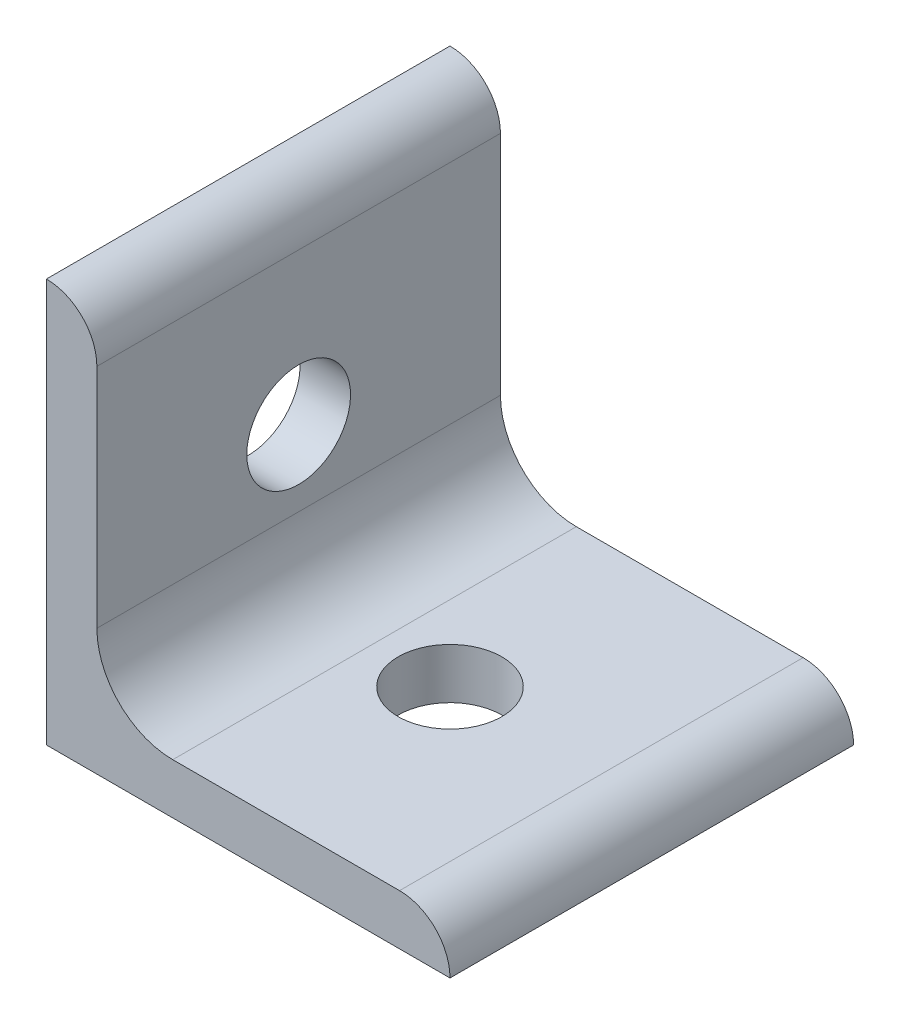
ISO-10303-21;
HEADER;
FILE_DESCRIPTION(('STEP AP214'),'2;1');
FILE_NAME('part.step','',(''),(''),'','','');
FILE_SCHEMA(('AUTOMOTIVE_DESIGN { 1 0 10303 214 1 1 1 1 }'));
ENDSEC;
DATA;
#1=APPLICATION_CONTEXT('core data for automotive mechanical design processes');
#2=APPLICATION_PROTOCOL_DEFINITION('international standard','automotive_design',2000,#1);
#3=PRODUCT_CONTEXT('',#1,'mechanical');
#4=PRODUCT('Part','Part','',(#3));
#5=PRODUCT_RELATED_PRODUCT_CATEGORY('part','',(#4));
#6=PRODUCT_DEFINITION_FORMATION('','',#4);
#7=PRODUCT_DEFINITION_CONTEXT('part definition',#1,'design');
#8=PRODUCT_DEFINITION('design','',#6,#7);
#9=PRODUCT_DEFINITION_SHAPE('','',#8);
#10=(LENGTH_UNIT() NAMED_UNIT(*) SI_UNIT(.MILLI.,.METRE.));
#11=(NAMED_UNIT(*) PLANE_ANGLE_UNIT() SI_UNIT($,.RADIAN.));
#12=(NAMED_UNIT(*) SI_UNIT($,.STERADIAN.) SOLID_ANGLE_UNIT());
#13=UNCERTAINTY_MEASURE_WITH_UNIT(LENGTH_MEASURE(1.E-05),#10,'distance_accuracy_value','');
#14=(GEOMETRIC_REPRESENTATION_CONTEXT(3) GLOBAL_UNCERTAINTY_ASSIGNED_CONTEXT((#13)) GLOBAL_UNIT_ASSIGNED_CONTEXT((#10,
#11,#12)) REPRESENTATION_CONTEXT('',''));
#15=CARTESIAN_POINT('',(0.,0.,0.));
#16=DIRECTION('',(0.,0.,1.));
#17=DIRECTION('',(1.,0.,0.));
#18=AXIS2_PLACEMENT_3D('',#15,#16,#17);
#19=CARTESIAN_POINT('',(23.47304696449,-4.87140320733104,0.));
#20=DIRECTION('',(0.,0.,1.));
#21=DIRECTION('',(1.,0.,0.));
#22=AXIS2_PLACEMENT_3D('',#19,#20,#21);
#23=CYLINDRICAL_SURFACE('',#22,3.175);
#24=CARTESIAN_POINT('',(23.47304696449,-4.87140320733104,25.4));
#25=DIRECTION('',(0.,0.,1.));
#26=DIRECTION('',(1.,0.,0.));
#27=AXIS2_PLACEMENT_3D('',#24,#25,#26);
#28=CIRCLE('',#27,3.175);
#29=CARTESIAN_POINT('',(26.64804696449,-4.87140320733101,25.4));
#30=VERTEX_POINT('',#29);
#31=CARTESIAN_POINT('',(23.47304696449,-1.69640320733104,25.4));
#32=VERTEX_POINT('',#31);
#33=EDGE_CURVE('E131',#30,#32,#28,.T.);
#34=ORIENTED_EDGE('',*,*,#33,.F.);
#35=DIRECTION('',(0.,0.,1.));
#36=VECTOR('',#35,1.);
#37=CARTESIAN_POINT('',(26.64804696449,-4.87140320733101,0.));
#38=LINE('',#37,#36);
#39=CARTESIAN_POINT('',(26.64804696449,-4.87140320733101,0.));
#40=VERTEX_POINT('',#39);
#41=EDGE_CURVE('E114',#40,#30,#38,.T.);
#42=ORIENTED_EDGE('',*,*,#41,.F.);
#43=CARTESIAN_POINT('',(23.47304696449,-4.87140320733104,0.));
#44=DIRECTION('',(0.,0.,1.));
#45=DIRECTION('',(1.,0.,0.));
#46=AXIS2_PLACEMENT_3D('',#43,#44,#45);
#47=CIRCLE('',#46,3.175);
#48=CARTESIAN_POINT('',(23.47304696449,-1.69640320733104,0.));
#49=VERTEX_POINT('',#48);
#50=EDGE_CURVE('E107',#40,#49,#47,.T.);
#51=ORIENTED_EDGE('',*,*,#50,.T.);
#52=DIRECTION('',(0.,0.,1.));
#53=VECTOR('',#52,1.);
#54=CARTESIAN_POINT('',(23.47304696449,-1.69640320733104,0.));
#55=LINE('',#54,#53);
#56=EDGE_CURVE('E90',#49,#32,#55,.T.);
#57=ORIENTED_EDGE('',*,*,#56,.T.);
#58=EDGE_LOOP('',(#34,#42,#51,#57));
#59=FACE_BOUND('',#58,.T.);
#60=ADVANCED_FACE('F33',(#59),#23,.T.);
#61=CARTESIAN_POINT('',(26.6480469644902,-23.921403207331,0.));
#62=DIRECTION('',(1.,0.,0.));
#63=DIRECTION('',(0.,1.,0.));
#64=AXIS2_PLACEMENT_3D('',#61,#62,#63);
#65=PLANE('',#64);
#66=CARTESIAN_POINT('',(26.6480469644901,-14.396403207331,12.7));
#67=DIRECTION('',(1.,0.,0.));
#68=DIRECTION('',(0.,1.,0.));
#69=AXIS2_PLACEMENT_3D('',#66,#67,#68);
#70=CIRCLE('',#69,3.26389999999999);
#71=CARTESIAN_POINT('',(26.6480469644901,-11.1325032073311,12.7));
#72=VERTEX_POINT('',#71);
#73=EDGE_CURVE('E204',#72,#72,#70,.T.);
#74=ORIENTED_EDGE('',*,*,#73,.F.);
#75=EDGE_LOOP('',(#74));
#76=FACE_BOUND('',#75,.T.);
#77=DIRECTION('',(0.,1.,0.));
#78=VECTOR('',#77,1.);
#79=CARTESIAN_POINT('',(26.6480469644902,-23.921403207331,25.4));
#80=LINE('',#79,#78);
#81=CARTESIAN_POINT('',(26.6480469644902,-19.146203207331,25.4));
#82=VERTEX_POINT('',#81);
#83=EDGE_CURVE('E115',#82,#30,#80,.T.);
#84=ORIENTED_EDGE('',*,*,#83,.F.);
#85=DIRECTION('',(0.,0.,1.));
#86=VECTOR('',#85,1.);
#87=CARTESIAN_POINT('',(26.6480469644902,-19.146203207331,0.));
#88=LINE('',#87,#86);
#89=CARTESIAN_POINT('',(26.6480469644902,-19.146203207331,0.));
#90=VERTEX_POINT('',#89);
#91=EDGE_CURVE('E48',#82,#90,#88,.F.);
#92=ORIENTED_EDGE('',*,*,#91,.T.);
#93=DIRECTION('',(0.,1.,0.));
#94=VECTOR('',#93,1.);
#95=CARTESIAN_POINT('',(26.6480469644902,-23.921403207331,0.));
#96=LINE('',#95,#94);
#97=EDGE_CURVE('E101',#90,#40,#96,.T.);
#98=ORIENTED_EDGE('',*,*,#97,.T.);
#99=ORIENTED_EDGE('',*,*,#41,.T.);
#100=EDGE_LOOP('',(#84,#92,#98,#99));
#101=FACE_BOUND('',#100,.T.);
#102=ADVANCED_FACE('F171',(#76,#101),#65,.T.);
#103=CARTESIAN_POINT('',(45.6980469644902,-23.9214032073307,0.));
#104=DIRECTION('',(0.,1.,0.));
#105=DIRECTION('',(-1.,0.,0.));
#106=AXIS2_PLACEMENT_3D('',#103,#104,#105);
#107=PLANE('',#106);
#108=CARTESIAN_POINT('',(36.1730469644901,-23.9214032073308,12.7));
#109=DIRECTION('',(0.,1.,0.));
#110=DIRECTION('',(-1.,0.,0.));
#111=AXIS2_PLACEMENT_3D('',#108,#109,#110);
#112=CIRCLE('',#111,3.26389999999999);
#113=CARTESIAN_POINT('',(32.9091469644901,-23.9214032073309,12.7));
#114=VERTEX_POINT('',#113);
#115=EDGE_CURVE('E120',#114,#114,#112,.T.);
#116=ORIENTED_EDGE('',*,*,#115,.F.);
#117=EDGE_LOOP('',(#116));
#118=FACE_BOUND('',#117,.T.);
#119=DIRECTION('',(-1.,0.,0.));
#120=VECTOR('',#119,1.);
#121=CARTESIAN_POINT('',(45.6980469644902,-23.9214032073307,0.));
#122=LINE('',#121,#120);
#123=CARTESIAN_POINT('',(45.6980469644902,-23.9214032073309,0.));
#124=VERTEX_POINT('',#123);
#125=CARTESIAN_POINT('',(31.4232469644903,-23.9214032073309,0.));
#126=VERTEX_POINT('',#125);
#127=EDGE_CURVE('E127',#124,#126,#122,.T.);
#128=ORIENTED_EDGE('',*,*,#127,.T.);
#129=DIRECTION('',(0.,0.,1.));
#130=VECTOR('',#129,1.);
#131=CARTESIAN_POINT('',(31.4232469644903,-23.9214032073309,25.4));
#132=LINE('',#131,#130);
#133=CARTESIAN_POINT('',(31.4232469644903,-23.9214032073309,25.4));
#134=VERTEX_POINT('',#133);
#135=EDGE_CURVE('E142',#126,#134,#132,.T.);
#136=ORIENTED_EDGE('',*,*,#135,.T.);
#137=DIRECTION('',(-1.,0.,0.));
#138=VECTOR('',#137,1.);
#139=CARTESIAN_POINT('',(45.6980469644902,-23.9214032073307,25.4));
#140=LINE('',#139,#138);
#141=CARTESIAN_POINT('',(45.6980469644902,-23.9214032073309,25.4));
#142=VERTEX_POINT('',#141);
#143=EDGE_CURVE('E117',#142,#134,#140,.T.);
#144=ORIENTED_EDGE('',*,*,#143,.F.);
#145=DIRECTION('',(0.,0.,1.));
#146=VECTOR('',#145,1.);
#147=CARTESIAN_POINT('',(45.6980469644902,-23.9214032073309,0.));
#148=LINE('',#147,#146);
#149=EDGE_CURVE('E143',#124,#142,#148,.T.);
#150=ORIENTED_EDGE('',*,*,#149,.F.);
#151=EDGE_LOOP('',(#128,#136,#144,#150));
#152=FACE_BOUND('',#151,.T.);
#153=ADVANCED_FACE('F153',(#118,#152),#107,.T.);
#154=CARTESIAN_POINT('',(45.6980469644903,-27.096403207331,0.));
#155=DIRECTION('',(0.,0.,1.));
#156=DIRECTION('',(1.,0.,0.));
#157=AXIS2_PLACEMENT_3D('',#154,#155,#156);
#158=CYLINDRICAL_SURFACE('',#157,3.17500000000017);
#159=CARTESIAN_POINT('',(45.6980469644903,-27.096403207331,25.4));
#160=DIRECTION('',(0.,0.,1.));
#161=DIRECTION('',(1.,0.,0.));
#162=AXIS2_PLACEMENT_3D('',#159,#160,#161);
#163=CIRCLE('',#162,3.17500000000017);
#164=CARTESIAN_POINT('',(48.8730469644903,-27.096403207331,25.4));
#165=VERTEX_POINT('',#164);
#166=EDGE_CURVE('E137',#165,#142,#163,.T.);
#167=ORIENTED_EDGE('',*,*,#166,.F.);
#168=DIRECTION('',(0.,0.,1.));
#169=VECTOR('',#168,1.);
#170=CARTESIAN_POINT('',(48.8730469644903,-27.096403207331,0.));
#171=LINE('',#170,#169);
#172=CARTESIAN_POINT('',(48.8730469644903,-27.096403207331,0.));
#173=VERTEX_POINT('',#172);
#174=EDGE_CURVE('E145',#173,#165,#171,.T.);
#175=ORIENTED_EDGE('',*,*,#174,.F.);
#176=CARTESIAN_POINT('',(45.6980469644903,-27.096403207331,0.));
#177=DIRECTION('',(0.,0.,1.));
#178=DIRECTION('',(1.,0.,0.));
#179=AXIS2_PLACEMENT_3D('',#176,#177,#178);
#180=CIRCLE('',#179,3.17500000000017);
#181=EDGE_CURVE('E124',#173,#124,#180,.T.);
#182=ORIENTED_EDGE('',*,*,#181,.T.);
#183=ORIENTED_EDGE('',*,*,#149,.T.);
#184=EDGE_LOOP('',(#167,#175,#182,#183));
#185=FACE_BOUND('',#184,.T.);
#186=ADVANCED_FACE('F161',(#185),#158,.T.);
#187=CARTESIAN_POINT('',(23.47304696449,-27.096403207331,0.));
#188=DIRECTION('',(0.,-1.,0.));
#189=DIRECTION('',(0.,0.,-1.));
#190=AXIS2_PLACEMENT_3D('',#187,#188,#189);
#191=PLANE('',#190);
#192=CARTESIAN_POINT('',(36.1730469644901,-27.096403207331,12.7));
#193=DIRECTION('',(0.,-1.,0.));
#194=DIRECTION('',(0.,0.,-1.));
#195=AXIS2_PLACEMENT_3D('',#192,#193,#194);
#196=CIRCLE('',#195,3.26389999999999);
#197=CARTESIAN_POINT('',(36.1730469644901,-27.096403207331,9.43610000000001));
#198=VERTEX_POINT('',#197);
#199=EDGE_CURVE('E203',#198,#198,#196,.T.);
#200=ORIENTED_EDGE('',*,*,#199,.F.);
#201=EDGE_LOOP('',(#200));
#202=FACE_BOUND('',#201,.T.);
#203=DIRECTION('',(1.,0.,0.));
#204=VECTOR('',#203,1.);
#205=CARTESIAN_POINT('',(23.47304696449,-27.096403207331,25.4));
#206=LINE('',#205,#204);
#207=CARTESIAN_POINT('',(23.47304696449,-27.096403207331,25.4));
#208=VERTEX_POINT('',#207);
#209=EDGE_CURVE('E134',#208,#165,#206,.T.);
#210=ORIENTED_EDGE('',*,*,#209,.F.);
#211=DIRECTION('',(0.,0.,1.));
#212=VECTOR('',#211,1.);
#213=CARTESIAN_POINT('',(23.47304696449,-27.096403207331,0.));
#214=LINE('',#213,#212);
#215=CARTESIAN_POINT('',(23.47304696449,-27.096403207331,0.));
#216=VERTEX_POINT('',#215);
#217=EDGE_CURVE('E100',#216,#208,#214,.T.);
#218=ORIENTED_EDGE('',*,*,#217,.F.);
#219=DIRECTION('',(1.,0.,0.));
#220=VECTOR('',#219,1.);
#221=CARTESIAN_POINT('',(23.47304696449,-27.096403207331,0.));
#222=LINE('',#221,#220);
#223=EDGE_CURVE('E110',#216,#173,#222,.T.);
#224=ORIENTED_EDGE('',*,*,#223,.T.);
#225=ORIENTED_EDGE('',*,*,#174,.T.);
#226=EDGE_LOOP('',(#210,#218,#224,#225));
#227=FACE_BOUND('',#226,.T.);
#228=ADVANCED_FACE('F180',(#202,#227),#191,.T.);
#229=CARTESIAN_POINT('',(23.47304696449,-1.69640320733104,0.));
#230=DIRECTION('',(-1.,0.,0.));
#231=DIRECTION('',(0.,-1.,0.));
#232=AXIS2_PLACEMENT_3D('',#229,#230,#231);
#233=PLANE('',#232);
#234=CARTESIAN_POINT('',(23.47304696449,-14.396403207331,12.7));
#235=DIRECTION('',(-1.,0.,0.));
#236=DIRECTION('',(0.,0.,1.));
#237=AXIS2_PLACEMENT_3D('',#234,#235,#236);
#238=CIRCLE('',#237,3.26389999999999);
#239=CARTESIAN_POINT('',(23.47304696449,-14.396403207331,15.9639));
#240=VERTEX_POINT('',#239);
#241=EDGE_CURVE('E206',#240,#240,#238,.T.);
#242=ORIENTED_EDGE('',*,*,#241,.F.);
#243=EDGE_LOOP('',(#242));
#244=FACE_BOUND('',#243,.T.);
#245=DIRECTION('',(0.,-1.,0.));
#246=VECTOR('',#245,1.);
#247=CARTESIAN_POINT('',(23.47304696449,-1.69640320733104,25.4));
#248=LINE('',#247,#246);
#249=EDGE_CURVE('E95',#32,#208,#248,.T.);
#250=ORIENTED_EDGE('',*,*,#249,.F.);
#251=ORIENTED_EDGE('',*,*,#56,.F.);
#252=DIRECTION('',(0.,-1.,0.));
#253=VECTOR('',#252,1.);
#254=CARTESIAN_POINT('',(23.47304696449,-1.69640320733104,0.));
#255=LINE('',#254,#253);
#256=EDGE_CURVE('E93',#49,#216,#255,.T.);
#257=ORIENTED_EDGE('',*,*,#256,.T.);
#258=ORIENTED_EDGE('',*,*,#217,.T.);
#259=EDGE_LOOP('',(#250,#251,#257,#258));
#260=FACE_BOUND('',#259,.T.);
#261=ADVANCED_FACE('F92',(#244,#260),#233,.T.);
#262=CARTESIAN_POINT('',(23.47304696449,-4.87140320733104,0.));
#263=DIRECTION('',(0.,0.,1.));
#264=DIRECTION('',(1.,0.,0.));
#265=AXIS2_PLACEMENT_3D('',#262,#263,#264);
#266=PLANE('',#265);
#267=ORIENTED_EDGE('',*,*,#50,.F.);
#268=ORIENTED_EDGE('',*,*,#97,.F.);
#269=CARTESIAN_POINT('',(31.4232469644902,-19.1462032073309,0.));
#270=DIRECTION('',(0.,0.,1.));
#271=DIRECTION('',(1.,0.,0.));
#272=AXIS2_PLACEMENT_3D('',#269,#270,#271);
#273=CIRCLE('',#272,4.7752);
#274=EDGE_CURVE('E11',#90,#126,#273,.T.);
#275=ORIENTED_EDGE('',*,*,#274,.T.);
#276=ORIENTED_EDGE('',*,*,#127,.F.);
#277=ORIENTED_EDGE('',*,*,#181,.F.);
#278=ORIENTED_EDGE('',*,*,#223,.F.);
#279=ORIENTED_EDGE('',*,*,#256,.F.);
#280=EDGE_LOOP('',(#267,#268,#275,#276,#277,#278,#279));
#281=FACE_BOUND('',#280,.T.);
#282=ADVANCED_FACE('F106',(#281),#266,.F.);
#283=CARTESIAN_POINT('',(23.47304696449,-4.87140320733104,25.4));
#284=DIRECTION('',(0.,0.,1.));
#285=DIRECTION('',(1.,0.,0.));
#286=AXIS2_PLACEMENT_3D('',#283,#284,#285);
#287=PLANE('',#286);
#288=ORIENTED_EDGE('',*,*,#33,.T.);
#289=ORIENTED_EDGE('',*,*,#249,.T.);
#290=ORIENTED_EDGE('',*,*,#209,.T.);
#291=ORIENTED_EDGE('',*,*,#166,.T.);
#292=ORIENTED_EDGE('',*,*,#143,.T.);
#293=CARTESIAN_POINT('',(31.4232469644902,-19.1462032073309,25.4));
#294=DIRECTION('',(0.,0.,1.));
#295=DIRECTION('',(1.,0.,0.));
#296=AXIS2_PLACEMENT_3D('',#293,#294,#295);
#297=CIRCLE('',#296,4.7752);
#298=EDGE_CURVE('E41',#134,#82,#297,.F.);
#299=ORIENTED_EDGE('',*,*,#298,.T.);
#300=ORIENTED_EDGE('',*,*,#83,.T.);
#301=EDGE_LOOP('',(#288,#289,#290,#291,#292,#299,#300));
#302=FACE_BOUND('',#301,.T.);
#303=ADVANCED_FACE('F157',(#302),#287,.T.);
#304=CARTESIAN_POINT('',(36.1730469644901,-27.096403207331,12.7));
#305=DIRECTION('',(0.,-1.,0.));
#306=DIRECTION('',(0.,0.,-1.));
#307=AXIS2_PLACEMENT_3D('',#304,#305,#306);
#308=CYLINDRICAL_SURFACE('',#307,3.26389999999999);
#309=ORIENTED_EDGE('',*,*,#115,.T.);
#310=EDGE_LOOP('',(#309));
#311=FACE_BOUND('',#310,.T.);
#312=ORIENTED_EDGE('',*,*,#199,.T.);
#313=EDGE_LOOP('',(#312));
#314=FACE_BOUND('',#313,.T.);
#315=ADVANCED_FACE('F167',(#311,#314),#308,.F.);
#316=CARTESIAN_POINT('',(23.47304696449,-14.396403207331,12.7));
#317=DIRECTION('',(-1.,0.,0.));
#318=DIRECTION('',(0.,0.,1.));
#319=AXIS2_PLACEMENT_3D('',#316,#317,#318);
#320=CYLINDRICAL_SURFACE('',#319,3.26389999999999);
#321=ORIENTED_EDGE('',*,*,#73,.T.);
#322=EDGE_LOOP('',(#321));
#323=FACE_BOUND('',#322,.T.);
#324=ORIENTED_EDGE('',*,*,#241,.T.);
#325=EDGE_LOOP('',(#324));
#326=FACE_BOUND('',#325,.T.);
#327=ADVANCED_FACE('F163',(#323,#326),#320,.F.);
#328=CARTESIAN_POINT('',(31.4232469644902,-19.1462032073309,0.));
#329=DIRECTION('',(0.,0.,-1.));
#330=DIRECTION('',(-1.,0.,0.));
#331=AXIS2_PLACEMENT_3D('',#328,#329,#330);
#332=CYLINDRICAL_SURFACE('',#331,4.7752);
#333=ORIENTED_EDGE('',*,*,#274,.F.);
#334=ORIENTED_EDGE('',*,*,#91,.F.);
#335=ORIENTED_EDGE('',*,*,#298,.F.);
#336=ORIENTED_EDGE('',*,*,#135,.F.);
#337=EDGE_LOOP('',(#333,#334,#335,#336));
#338=FACE_BOUND('',#337,.T.);
#339=ADVANCED_FACE('F35',(#338),#332,.F.);
#340=CLOSED_SHELL('',(#60,#102,#153,#186,#228,#261,#282,#303,#315,#327,#339));
#341=MANIFOLD_SOLID_BREP('B2',#340);
#342=ADVANCED_BREP_SHAPE_REPRESENTATION('',(#18,#341),#14);
#343=SHAPE_DEFINITION_REPRESENTATION(#9,#342);
ENDSEC;
END-ISO-10303-21;
